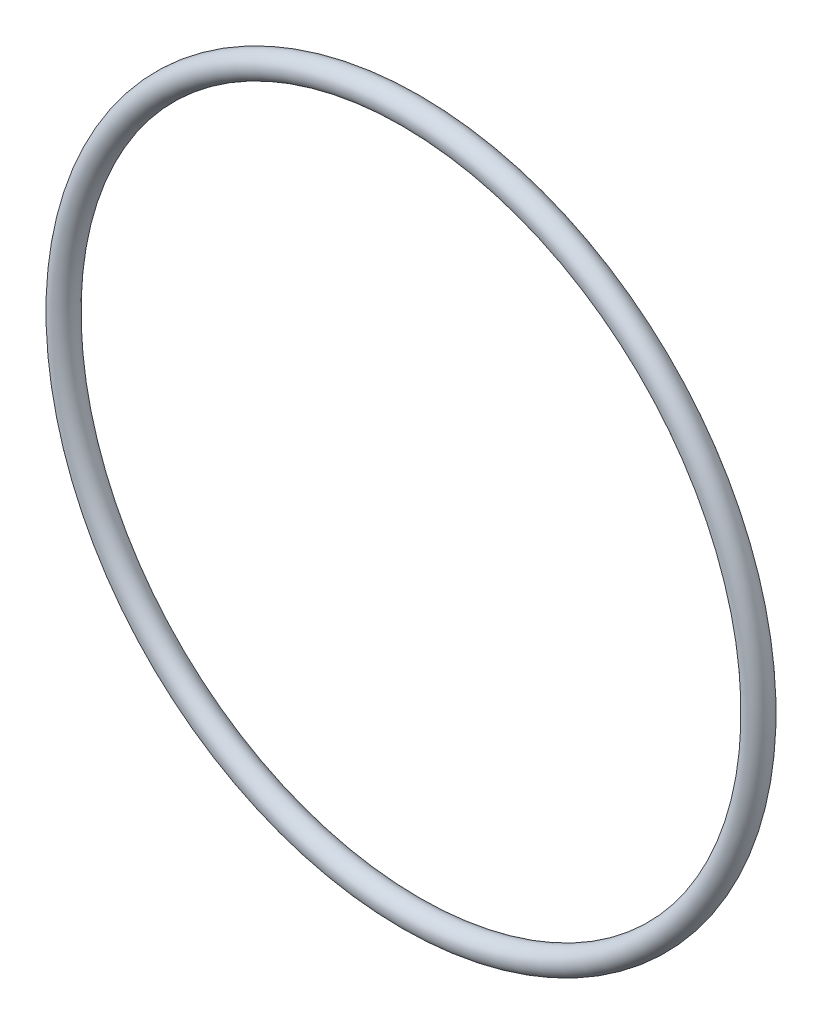
ISO-10303-21;
HEADER;
FILE_DESCRIPTION(('STEP AP214'),'2;1');
FILE_NAME('part.step','',(''),(''),'','','');
FILE_SCHEMA(('AUTOMOTIVE_DESIGN { 1 0 10303 214 1 1 1 1 }'));
ENDSEC;
DATA;
#1=APPLICATION_CONTEXT('core data for automotive mechanical design processes');
#2=APPLICATION_PROTOCOL_DEFINITION('international standard','automotive_design',2000,#1);
#3=PRODUCT_CONTEXT('',#1,'mechanical');
#4=PRODUCT('Part','Part','',(#3));
#5=PRODUCT_RELATED_PRODUCT_CATEGORY('part','',(#4));
#6=PRODUCT_DEFINITION_FORMATION('','',#4);
#7=PRODUCT_DEFINITION_CONTEXT('part definition',#1,'design');
#8=PRODUCT_DEFINITION('design','',#6,#7);
#9=PRODUCT_DEFINITION_SHAPE('','',#8);
#10=(LENGTH_UNIT() NAMED_UNIT(*) SI_UNIT(.MILLI.,.METRE.));
#11=(NAMED_UNIT(*) PLANE_ANGLE_UNIT() SI_UNIT($,.RADIAN.));
#12=(NAMED_UNIT(*) SI_UNIT($,.STERADIAN.) SOLID_ANGLE_UNIT());
#13=UNCERTAINTY_MEASURE_WITH_UNIT(LENGTH_MEASURE(1.E-05),#10,'distance_accuracy_value','');
#14=(GEOMETRIC_REPRESENTATION_CONTEXT(3) GLOBAL_UNCERTAINTY_ASSIGNED_CONTEXT((#13)) GLOBAL_UNIT_ASSIGNED_CONTEXT((#10,
#11,#12)) REPRESENTATION_CONTEXT('',''));
#15=CARTESIAN_POINT('',(0.,0.,0.));
#16=DIRECTION('',(0.,0.,1.));
#17=DIRECTION('',(1.,0.,0.));
#18=AXIS2_PLACEMENT_3D('',#15,#16,#17);
#19=CARTESIAN_POINT('',(0.,0.,1.6));
#20=DIRECTION('',(0.,0.,-1.));
#21=DIRECTION('',(0.,1.,0.));
#22=AXIS2_PLACEMENT_3D('',#19,#20,#21);
#23=TOROIDAL_SURFACE('',#22,1.4,0.0499999999999999);
#24=CARTESIAN_POINT('',(0.,1.45,1.6));
#25=VERTEX_POINT('',#24);
#26=VERTEX_LOOP('',#25);
#27=FACE_BOUND('',#26,.T.);
#28=ADVANCED_FACE('F13',(#27),#23,.T.);
#29=CLOSED_SHELL('',(#28));
#30=MANIFOLD_SOLID_BREP('B1',#29);
#31=ADVANCED_BREP_SHAPE_REPRESENTATION('',(#18,#30),#14);
#32=SHAPE_DEFINITION_REPRESENTATION(#9,#31);
ENDSEC;
END-ISO-10303-21;
